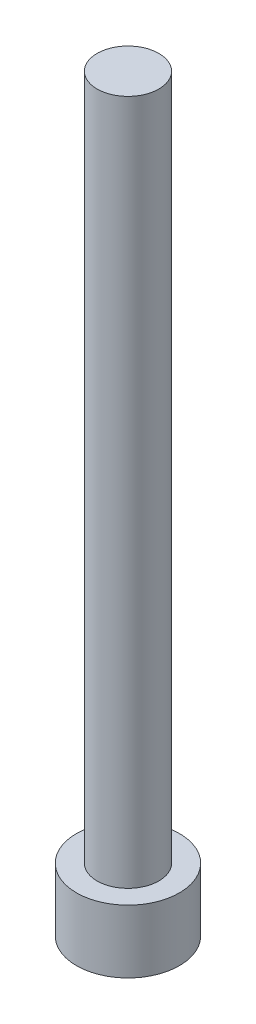
ISO-10303-21;
HEADER;
FILE_DESCRIPTION(('STEP AP214'),'2;1');
FILE_NAME('part.step','',(''),(''),'','','');
FILE_SCHEMA(('AUTOMOTIVE_DESIGN { 1 0 10303 214 1 1 1 1 }'));
ENDSEC;
DATA;
#1=APPLICATION_CONTEXT('core data for automotive mechanical design processes');
#2=APPLICATION_PROTOCOL_DEFINITION('international standard','automotive_design',2000,#1);
#3=PRODUCT_CONTEXT('',#1,'mechanical');
#4=PRODUCT('Part','Part','',(#3));
#5=PRODUCT_RELATED_PRODUCT_CATEGORY('part','',(#4));
#6=PRODUCT_DEFINITION_FORMATION('','',#4);
#7=PRODUCT_DEFINITION_CONTEXT('part definition',#1,'design');
#8=PRODUCT_DEFINITION('design','',#6,#7);
#9=PRODUCT_DEFINITION_SHAPE('','',#8);
#10=(LENGTH_UNIT() NAMED_UNIT(*) SI_UNIT(.MILLI.,.METRE.));
#11=(NAMED_UNIT(*) PLANE_ANGLE_UNIT() SI_UNIT($,.RADIAN.));
#12=(NAMED_UNIT(*) SI_UNIT($,.STERADIAN.) SOLID_ANGLE_UNIT());
#13=UNCERTAINTY_MEASURE_WITH_UNIT(LENGTH_MEASURE(1.E-05),#10,'distance_accuracy_value','');
#14=(GEOMETRIC_REPRESENTATION_CONTEXT(3) GLOBAL_UNCERTAINTY_ASSIGNED_CONTEXT((#13)) GLOBAL_UNIT_ASSIGNED_CONTEXT((#10,
#11,#12)) REPRESENTATION_CONTEXT('',''));
#15=CARTESIAN_POINT('',(0.,0.,0.));
#16=DIRECTION('',(0.,0.,1.));
#17=DIRECTION('',(1.,0.,0.));
#18=AXIS2_PLACEMENT_3D('',#15,#16,#17);
#19=CARTESIAN_POINT('',(0.,3.5052,0.));
#20=DIRECTION('',(0.,1.,0.));
#21=DIRECTION('',(0.,0.,1.));
#22=AXIS2_PLACEMENT_3D('',#19,#20,#21);
#23=PLANE('',#22);
#24=CARTESIAN_POINT('',(0.,3.5052,0.));
#25=DIRECTION('',(0.,1.,0.));
#26=DIRECTION('',(0.,0.,1.));
#27=AXIS2_PLACEMENT_3D('',#24,#25,#26);
#28=CIRCLE('',#27,2.8575);
#29=CARTESIAN_POINT('',(0.,3.5052,2.8575));
#30=VERTEX_POINT('',#29);
#31=EDGE_CURVE('E11',#30,#30,#28,.T.);
#32=ORIENTED_EDGE('',*,*,#31,.T.);
#33=EDGE_LOOP('',(#32));
#34=FACE_BOUND('',#33,.T.);
#35=CARTESIAN_POINT('',(0.,3.5052,0.));
#36=DIRECTION('',(0.,1.,0.));
#37=DIRECTION('',(0.,0.,1.));
#38=AXIS2_PLACEMENT_3D('',#35,#36,#37);
#39=CIRCLE('',#38,1.7145);
#40=CARTESIAN_POINT('',(0.,3.5052,1.7145));
#41=VERTEX_POINT('',#40);
#42=EDGE_CURVE('E152',#41,#41,#39,.T.);
#43=ORIENTED_EDGE('',*,*,#42,.F.);
#44=EDGE_LOOP('',(#43));
#45=FACE_BOUND('',#44,.T.);
#46=ADVANCED_FACE('F33',(#34,#45),#23,.T.);
#47=CARTESIAN_POINT('',(0.,3.5052,0.));
#48=DIRECTION('',(0.,-1.,0.));
#49=DIRECTION('',(0.,0.,-1.));
#50=AXIS2_PLACEMENT_3D('',#47,#48,#49);
#51=CYLINDRICAL_SURFACE('',#50,2.8575);
#52=ORIENTED_EDGE('',*,*,#31,.F.);
#53=EDGE_LOOP('',(#52));
#54=FACE_BOUND('',#53,.T.);
#55=CARTESIAN_POINT('',(0.,0.,0.));
#56=DIRECTION('',(0.,1.,0.));
#57=DIRECTION('',(0.,0.,1.));
#58=AXIS2_PLACEMENT_3D('',#55,#56,#57);
#59=CIRCLE('',#58,2.8575);
#60=CARTESIAN_POINT('',(0.,0.,2.8575));
#61=VERTEX_POINT('',#60);
#62=EDGE_CURVE('E37',#61,#61,#59,.T.);
#63=ORIENTED_EDGE('',*,*,#62,.T.);
#64=EDGE_LOOP('',(#63));
#65=FACE_BOUND('',#64,.T.);
#66=ADVANCED_FACE('F35',(#54,#65),#51,.T.);
#67=CARTESIAN_POINT('',(0.,0.,0.));
#68=DIRECTION('',(0.,1.,0.));
#69=DIRECTION('',(0.,0.,1.));
#70=AXIS2_PLACEMENT_3D('',#67,#68,#69);
#71=PLANE('',#70);
#72=DIRECTION('',(-0.500000000000001,0.,0.866025403784438));
#73=VECTOR('',#72,1.);
#74=CARTESIAN_POINT('',(1.60395121659243,0.,0.));
#75=LINE('',#74,#73);
#76=CARTESIAN_POINT('',(1.60395121659243,0.,0.));
#77=VERTEX_POINT('',#76);
#78=CARTESIAN_POINT('',(0.801975608296214,0.,1.3890625));
#79=VERTEX_POINT('',#78);
#80=EDGE_CURVE('E122',#77,#79,#75,.T.);
#81=ORIENTED_EDGE('',*,*,#80,.F.);
#82=DIRECTION('',(0.5,0.,0.866025403784439));
#83=VECTOR('',#82,1.);
#84=CARTESIAN_POINT('',(0.801975608296215,0.,-1.3890625));
#85=LINE('',#84,#83);
#86=CARTESIAN_POINT('',(0.801975608296215,0.,-1.3890625));
#87=VERTEX_POINT('',#86);
#88=EDGE_CURVE('E48',#87,#77,#85,.T.);
#89=ORIENTED_EDGE('',*,*,#88,.F.);
#90=DIRECTION('',(1.,0.,0.));
#91=VECTOR('',#90,1.);
#92=CARTESIAN_POINT('',(-0.801975608296214,0.,-1.3890625));
#93=LINE('',#92,#91);
#94=CARTESIAN_POINT('',(-0.801975608296214,0.,-1.3890625));
#95=VERTEX_POINT('',#94);
#96=EDGE_CURVE('E132',#95,#87,#93,.T.);
#97=ORIENTED_EDGE('',*,*,#96,.F.);
#98=DIRECTION('',(0.5,0.,-0.866025403784438));
#99=VECTOR('',#98,1.);
#100=CARTESIAN_POINT('',(-1.60395121659243,0.,0.));
#101=LINE('',#100,#99);
#102=CARTESIAN_POINT('',(-1.60395121659243,0.,0.));
#103=VERTEX_POINT('',#102);
#104=EDGE_CURVE('E130',#103,#95,#101,.T.);
#105=ORIENTED_EDGE('',*,*,#104,.F.);
#106=DIRECTION('',(-0.5,0.,-0.866025403784439));
#107=VECTOR('',#106,1.);
#108=CARTESIAN_POINT('',(-0.801975608296214,0.,1.3890625));
#109=LINE('',#108,#107);
#110=CARTESIAN_POINT('',(-0.801975608296214,0.,1.3890625));
#111=VERTEX_POINT('',#110);
#112=EDGE_CURVE('E96',#111,#103,#109,.T.);
#113=ORIENTED_EDGE('',*,*,#112,.F.);
#114=DIRECTION('',(-1.,0.,0.));
#115=VECTOR('',#114,1.);
#116=CARTESIAN_POINT('',(0.801975608296214,0.,1.3890625));
#117=LINE('',#116,#115);
#118=EDGE_CURVE('E126',#79,#111,#117,.T.);
#119=ORIENTED_EDGE('',*,*,#118,.F.);
#120=EDGE_LOOP('',(#81,#89,#97,#105,#113,#119));
#121=FACE_BOUND('',#120,.T.);
#122=ORIENTED_EDGE('',*,*,#62,.F.);
#123=EDGE_LOOP('',(#122));
#124=FACE_BOUND('',#123,.T.);
#125=ADVANCED_FACE('F145',(#121,#124),#71,.F.);
#126=CARTESIAN_POINT('',(0.801975608296215,1.9558,-1.3890625));
#127=DIRECTION('',(0.866025403784438,0.,-0.5));
#128=DIRECTION('',(-0.5,0.,-0.866025403784439));
#129=AXIS2_PLACEMENT_3D('',#126,#127,#128);
#130=PLANE('',#129);
#131=ORIENTED_EDGE('',*,*,#88,.T.);
#132=DIRECTION('',(0.,-1.,0.));
#133=VECTOR('',#132,1.);
#134=CARTESIAN_POINT('',(1.60395121659243,1.9558,0.));
#135=LINE('',#134,#133);
#136=CARTESIAN_POINT('',(1.60395121659243,1.9558,0.));
#137=VERTEX_POINT('',#136);
#138=EDGE_CURVE('E78',#137,#77,#135,.T.);
#139=ORIENTED_EDGE('',*,*,#138,.F.);
#140=DIRECTION('',(0.5,0.,0.866025403784439));
#141=VECTOR('',#140,1.);
#142=CARTESIAN_POINT('',(0.801975608296215,1.9558,-1.3890625));
#143=LINE('',#142,#141);
#144=CARTESIAN_POINT('',(0.801975608296215,1.9558,-1.3890625));
#145=VERTEX_POINT('',#144);
#146=EDGE_CURVE('E134',#145,#137,#143,.T.);
#147=ORIENTED_EDGE('',*,*,#146,.F.);
#148=DIRECTION('',(0.,-1.,0.));
#149=VECTOR('',#148,1.);
#150=CARTESIAN_POINT('',(0.801975608296215,1.9558,-1.3890625));
#151=LINE('',#150,#149);
#152=EDGE_CURVE('E56',#145,#87,#151,.T.);
#153=ORIENTED_EDGE('',*,*,#152,.T.);
#154=EDGE_LOOP('',(#131,#139,#147,#153));
#155=FACE_BOUND('',#154,.T.);
#156=ADVANCED_FACE('F174',(#155),#130,.F.);
#157=CARTESIAN_POINT('',(-0.801975608296214,1.9558,-1.3890625));
#158=DIRECTION('',(0.,0.,-1.));
#159=DIRECTION('',(-1.,0.,0.));
#160=AXIS2_PLACEMENT_3D('',#157,#158,#159);
#161=PLANE('',#160);
#162=ORIENTED_EDGE('',*,*,#96,.T.);
#163=ORIENTED_EDGE('',*,*,#152,.F.);
#164=DIRECTION('',(1.,0.,0.));
#165=VECTOR('',#164,1.);
#166=CARTESIAN_POINT('',(-0.801975608296214,1.9558,-1.3890625));
#167=LINE('',#166,#165);
#168=CARTESIAN_POINT('',(-0.801975608296214,1.9558,-1.3890625));
#169=VERTEX_POINT('',#168);
#170=EDGE_CURVE('E108',#169,#145,#167,.T.);
#171=ORIENTED_EDGE('',*,*,#170,.F.);
#172=DIRECTION('',(0.,-1.,0.));
#173=VECTOR('',#172,1.);
#174=CARTESIAN_POINT('',(-0.801975608296214,1.9558,-1.3890625));
#175=LINE('',#174,#173);
#176=EDGE_CURVE('E100',#169,#95,#175,.T.);
#177=ORIENTED_EDGE('',*,*,#176,.T.);
#178=EDGE_LOOP('',(#162,#163,#171,#177));
#179=FACE_BOUND('',#178,.T.);
#180=ADVANCED_FACE('F180',(#179),#161,.F.);
#181=CARTESIAN_POINT('',(-1.60395121659243,1.9558,0.));
#182=DIRECTION('',(-0.866025403784438,0.,-0.5));
#183=DIRECTION('',(-0.5,0.,0.866025403784439));
#184=AXIS2_PLACEMENT_3D('',#181,#182,#183);
#185=PLANE('',#184);
#186=ORIENTED_EDGE('',*,*,#104,.T.);
#187=ORIENTED_EDGE('',*,*,#176,.F.);
#188=DIRECTION('',(0.5,0.,-0.866025403784438));
#189=VECTOR('',#188,1.);
#190=CARTESIAN_POINT('',(-1.60395121659243,1.9558,0.));
#191=LINE('',#190,#189);
#192=CARTESIAN_POINT('',(-1.60395121659243,1.9558,0.));
#193=VERTEX_POINT('',#192);
#194=EDGE_CURVE('E104',#193,#169,#191,.T.);
#195=ORIENTED_EDGE('',*,*,#194,.F.);
#196=DIRECTION('',(0.,-1.,0.));
#197=VECTOR('',#196,1.);
#198=CARTESIAN_POINT('',(-1.60395121659243,1.9558,0.));
#199=LINE('',#198,#197);
#200=EDGE_CURVE('E89',#193,#103,#199,.T.);
#201=ORIENTED_EDGE('',*,*,#200,.T.);
#202=EDGE_LOOP('',(#186,#187,#195,#201));
#203=FACE_BOUND('',#202,.T.);
#204=ADVANCED_FACE('F105',(#203),#185,.F.);
#205=CARTESIAN_POINT('',(-0.801975608296214,1.9558,1.3890625));
#206=DIRECTION('',(-0.866025403784439,0.,0.5));
#207=DIRECTION('',(0.5,0.,0.866025403784439));
#208=AXIS2_PLACEMENT_3D('',#205,#206,#207);
#209=PLANE('',#208);
#210=ORIENTED_EDGE('',*,*,#112,.T.);
#211=ORIENTED_EDGE('',*,*,#200,.F.);
#212=DIRECTION('',(-0.5,0.,-0.866025403784439));
#213=VECTOR('',#212,1.);
#214=CARTESIAN_POINT('',(-0.801975608296214,1.9558,1.3890625));
#215=LINE('',#214,#213);
#216=CARTESIAN_POINT('',(-0.801975608296214,1.9558,1.3890625));
#217=VERTEX_POINT('',#216);
#218=EDGE_CURVE('E93',#217,#193,#215,.T.);
#219=ORIENTED_EDGE('',*,*,#218,.F.);
#220=DIRECTION('',(0.,-1.,0.));
#221=VECTOR('',#220,1.);
#222=CARTESIAN_POINT('',(-0.801975608296214,1.9558,1.3890625));
#223=LINE('',#222,#221);
#224=EDGE_CURVE('E101',#217,#111,#223,.T.);
#225=ORIENTED_EDGE('',*,*,#224,.T.);
#226=EDGE_LOOP('',(#210,#211,#219,#225));
#227=FACE_BOUND('',#226,.T.);
#228=ADVANCED_FACE('F91',(#227),#209,.F.);
#229=CARTESIAN_POINT('',(0.801975608296214,1.9558,1.3890625));
#230=DIRECTION('',(0.,0.,1.));
#231=DIRECTION('',(1.,0.,0.));
#232=AXIS2_PLACEMENT_3D('',#229,#230,#231);
#233=PLANE('',#232);
#234=ORIENTED_EDGE('',*,*,#118,.T.);
#235=ORIENTED_EDGE('',*,*,#224,.F.);
#236=DIRECTION('',(-1.,0.,0.));
#237=VECTOR('',#236,1.);
#238=CARTESIAN_POINT('',(0.801975608296214,1.9558,1.3890625));
#239=LINE('',#238,#237);
#240=CARTESIAN_POINT('',(0.801975608296214,1.9558,1.3890625));
#241=VERTEX_POINT('',#240);
#242=EDGE_CURVE('E114',#241,#217,#239,.T.);
#243=ORIENTED_EDGE('',*,*,#242,.F.);
#244=DIRECTION('',(0.,-1.,0.));
#245=VECTOR('',#244,1.);
#246=CARTESIAN_POINT('',(0.801975608296214,1.9558,1.3890625));
#247=LINE('',#246,#245);
#248=EDGE_CURVE('E138',#241,#79,#247,.T.);
#249=ORIENTED_EDGE('',*,*,#248,.T.);
#250=EDGE_LOOP('',(#234,#235,#243,#249));
#251=FACE_BOUND('',#250,.T.);
#252=ADVANCED_FACE('F149',(#251),#233,.F.);
#253=CARTESIAN_POINT('',(1.60395121659243,1.9558,0.));
#254=DIRECTION('',(0.866025403784438,0.,0.500000000000001));
#255=DIRECTION('',(0.500000000000001,0.,-0.866025403784438));
#256=AXIS2_PLACEMENT_3D('',#253,#254,#255);
#257=PLANE('',#256);
#258=ORIENTED_EDGE('',*,*,#80,.T.);
#259=ORIENTED_EDGE('',*,*,#248,.F.);
#260=DIRECTION('',(-0.500000000000001,0.,0.866025403784438));
#261=VECTOR('',#260,1.);
#262=CARTESIAN_POINT('',(1.60395121659243,1.9558,0.));
#263=LINE('',#262,#261);
#264=EDGE_CURVE('E116',#137,#241,#263,.T.);
#265=ORIENTED_EDGE('',*,*,#264,.F.);
#266=ORIENTED_EDGE('',*,*,#138,.T.);
#267=EDGE_LOOP('',(#258,#259,#265,#266));
#268=FACE_BOUND('',#267,.T.);
#269=ADVANCED_FACE('F142',(#268),#257,.F.);
#270=CARTESIAN_POINT('',(0.,1.9558,0.));
#271=DIRECTION('',(0.,-1.,0.));
#272=DIRECTION('',(0.,0.,-1.));
#273=AXIS2_PLACEMENT_3D('',#270,#271,#272);
#274=PLANE('',#273);
#275=ORIENTED_EDGE('',*,*,#146,.T.);
#276=ORIENTED_EDGE('',*,*,#264,.T.);
#277=ORIENTED_EDGE('',*,*,#242,.T.);
#278=ORIENTED_EDGE('',*,*,#218,.T.);
#279=ORIENTED_EDGE('',*,*,#194,.T.);
#280=ORIENTED_EDGE('',*,*,#170,.T.);
#281=EDGE_LOOP('',(#275,#276,#277,#278,#279,#280));
#282=FACE_BOUND('',#281,.T.);
#283=ADVANCED_FACE('F111',(#282),#274,.T.);
#284=CARTESIAN_POINT('',(0.,41.6052,0.));
#285=DIRECTION('',(0.,-1.,0.));
#286=DIRECTION('',(0.,0.,-1.));
#287=AXIS2_PLACEMENT_3D('',#284,#285,#286);
#288=CYLINDRICAL_SURFACE('',#287,1.7145);
#289=CARTESIAN_POINT('',(0.,41.6052,0.));
#290=DIRECTION('',(0.,1.,0.));
#291=DIRECTION('',(0.,0.,1.));
#292=AXIS2_PLACEMENT_3D('',#289,#290,#291);
#293=CIRCLE('',#292,1.7145);
#294=CARTESIAN_POINT('',(0.,41.6052,1.7145));
#295=VERTEX_POINT('',#294);
#296=EDGE_CURVE('E123',#295,#295,#293,.T.);
#297=ORIENTED_EDGE('',*,*,#296,.F.);
#298=EDGE_LOOP('',(#297));
#299=FACE_BOUND('',#298,.T.);
#300=ORIENTED_EDGE('',*,*,#42,.T.);
#301=EDGE_LOOP('',(#300));
#302=FACE_BOUND('',#301,.T.);
#303=ADVANCED_FACE('F160',(#299,#302),#288,.T.);
#304=CARTESIAN_POINT('',(0.,41.6052,0.));
#305=DIRECTION('',(0.,1.,0.));
#306=DIRECTION('',(0.,0.,1.));
#307=AXIS2_PLACEMENT_3D('',#304,#305,#306);
#308=PLANE('',#307);
#309=ORIENTED_EDGE('',*,*,#296,.T.);
#310=EDGE_LOOP('',(#309));
#311=FACE_BOUND('',#310,.T.);
#312=ADVANCED_FACE('F158',(#311),#308,.T.);
#313=CLOSED_SHELL('',(#46,#66,#125,#156,#180,#204,#228,#252,#269,#283,#303,#312));
#314=MANIFOLD_SOLID_BREP('B2',#313);
#315=ADVANCED_BREP_SHAPE_REPRESENTATION('',(#18,#314),#14);
#316=SHAPE_DEFINITION_REPRESENTATION(#9,#315);
ENDSEC;
END-ISO-10303-21;
